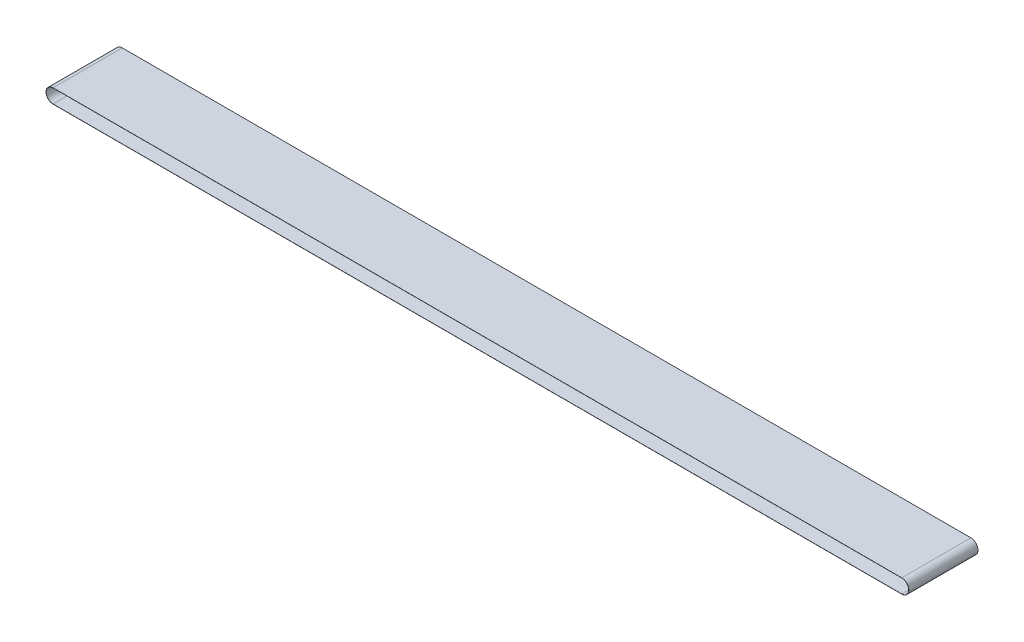
ISO-10303-21;
HEADER;
FILE_DESCRIPTION(('STEP AP214'),'2;1');
FILE_NAME('part.step','',(''),(''),'','','');
FILE_SCHEMA(('AUTOMOTIVE_DESIGN { 1 0 10303 214 1 1 1 1 }'));
ENDSEC;
DATA;
#1=APPLICATION_CONTEXT('core data for automotive mechanical design processes');
#2=APPLICATION_PROTOCOL_DEFINITION('international standard','automotive_design',2000,#1);
#3=PRODUCT_CONTEXT('',#1,'mechanical');
#4=PRODUCT('Part','Part','',(#3));
#5=PRODUCT_RELATED_PRODUCT_CATEGORY('part','',(#4));
#6=PRODUCT_DEFINITION_FORMATION('','',#4);
#7=PRODUCT_DEFINITION_CONTEXT('part definition',#1,'design');
#8=PRODUCT_DEFINITION('design','',#6,#7);
#9=PRODUCT_DEFINITION_SHAPE('','',#8);
#10=(LENGTH_UNIT() NAMED_UNIT(*) SI_UNIT(.MILLI.,.METRE.));
#11=(NAMED_UNIT(*) PLANE_ANGLE_UNIT() SI_UNIT($,.RADIAN.));
#12=(NAMED_UNIT(*) SI_UNIT($,.STERADIAN.) SOLID_ANGLE_UNIT());
#13=UNCERTAINTY_MEASURE_WITH_UNIT(LENGTH_MEASURE(1.E-05),#10,'distance_accuracy_value','');
#14=(GEOMETRIC_REPRESENTATION_CONTEXT(3) GLOBAL_UNCERTAINTY_ASSIGNED_CONTEXT((#13)) GLOBAL_UNIT_ASSIGNED_CONTEXT((#10,
#11,#12)) REPRESENTATION_CONTEXT('',''));
#15=CARTESIAN_POINT('',(0.,0.,0.));
#16=DIRECTION('',(0.,0.,1.));
#17=DIRECTION('',(1.,0.,0.));
#18=AXIS2_PLACEMENT_3D('',#15,#16,#17);
#19=CARTESIAN_POINT('',(0.,0.,250.));
#20=DIRECTION('',(0.,0.,1.));
#21=DIRECTION('',(1.,0.,0.));
#22=AXIS2_PLACEMENT_3D('',#19,#20,#21);
#23=PLANE('',#22);
#24=CARTESIAN_POINT('',(0.,0.,250.));
#25=DIRECTION('',(0.,0.,1.));
#26=DIRECTION('',(1.,0.,0.));
#27=AXIS2_PLACEMENT_3D('',#24,#25,#26);
#28=CIRCLE('',#27,51.2);
#29=CARTESIAN_POINT('',(0.,51.2,250.));
#30=VERTEX_POINT('',#29);
#31=CARTESIAN_POINT('',(0.,-51.2,250.));
#32=VERTEX_POINT('',#31);
#33=EDGE_CURVE('E134',#30,#32,#28,.T.);
#34=ORIENTED_EDGE('',*,*,#33,.T.);
#35=DIRECTION('',(1.,0.,0.));
#36=VECTOR('',#35,1.);
#37=CARTESIAN_POINT('',(0.,-51.2,250.));
#38=LINE('',#37,#36);
#39=CARTESIAN_POINT('',(6134.96,-51.2,250.));
#40=VERTEX_POINT('',#39);
#41=EDGE_CURVE('E137',#32,#40,#38,.T.);
#42=ORIENTED_EDGE('',*,*,#41,.T.);
#43=CARTESIAN_POINT('',(6134.96,0.,250.));
#44=DIRECTION('',(0.,0.,1.));
#45=DIRECTION('',(1.,0.,0.));
#46=AXIS2_PLACEMENT_3D('',#43,#44,#45);
#47=CIRCLE('',#46,51.2);
#48=CARTESIAN_POINT('',(6134.96,51.2,250.));
#49=VERTEX_POINT('',#48);
#50=EDGE_CURVE('E140',#40,#49,#47,.T.);
#51=ORIENTED_EDGE('',*,*,#50,.T.);
#52=DIRECTION('',(-1.,0.,0.));
#53=VECTOR('',#52,1.);
#54=CARTESIAN_POINT('',(0.,51.2,250.));
#55=LINE('',#54,#53);
#56=EDGE_CURVE('E142',#49,#30,#55,.T.);
#57=ORIENTED_EDGE('',*,*,#56,.T.);
#58=EDGE_LOOP('',(#34,#42,#51,#57));
#59=FACE_BOUND('',#58,.T.);
#60=DIRECTION('',(1.,0.,0.));
#61=VECTOR('',#60,1.);
#62=CARTESIAN_POINT('',(0.,-50.,250.));
#63=LINE('',#62,#61);
#64=CARTESIAN_POINT('',(0.,-50.,250.));
#65=VERTEX_POINT('',#64);
#66=CARTESIAN_POINT('',(6134.96,-50.,250.));
#67=VERTEX_POINT('',#66);
#68=EDGE_CURVE('E106',#65,#67,#63,.T.);
#69=ORIENTED_EDGE('',*,*,#68,.F.);
#70=CARTESIAN_POINT('',(0.,0.,250.));
#71=DIRECTION('',(0.,0.,1.));
#72=DIRECTION('',(1.,0.,0.));
#73=AXIS2_PLACEMENT_3D('',#70,#71,#72);
#74=CIRCLE('',#73,50.);
#75=CARTESIAN_POINT('',(0.,50.,250.));
#76=VERTEX_POINT('',#75);
#77=EDGE_CURVE('E98',#76,#65,#74,.T.);
#78=ORIENTED_EDGE('',*,*,#77,.F.);
#79=DIRECTION('',(-1.,0.,0.));
#80=VECTOR('',#79,1.);
#81=CARTESIAN_POINT('',(0.,50.,250.));
#82=LINE('',#81,#80);
#83=CARTESIAN_POINT('',(6134.96,50.,250.));
#84=VERTEX_POINT('',#83);
#85=EDGE_CURVE('E120',#84,#76,#82,.T.);
#86=ORIENTED_EDGE('',*,*,#85,.F.);
#87=CARTESIAN_POINT('',(6134.96,0.,250.));
#88=DIRECTION('',(0.,0.,1.));
#89=DIRECTION('',(1.,0.,0.));
#90=AXIS2_PLACEMENT_3D('',#87,#88,#89);
#91=CIRCLE('',#90,50.);
#92=EDGE_CURVE('E118',#67,#84,#91,.T.);
#93=ORIENTED_EDGE('',*,*,#92,.F.);
#94=EDGE_LOOP('',(#69,#78,#86,#93));
#95=FACE_BOUND('',#94,.T.);
#96=ADVANCED_FACE('F33',(#59,#95),#23,.T.);
#97=CARTESIAN_POINT('',(0.,0.,-250.));
#98=DIRECTION('',(0.,0.,1.));
#99=DIRECTION('',(1.,0.,0.));
#100=AXIS2_PLACEMENT_3D('',#97,#98,#99);
#101=PLANE('',#100);
#102=CARTESIAN_POINT('',(0.,0.,-250.));
#103=DIRECTION('',(0.,0.,1.));
#104=DIRECTION('',(1.,0.,0.));
#105=AXIS2_PLACEMENT_3D('',#102,#103,#104);
#106=CIRCLE('',#105,51.2);
#107=CARTESIAN_POINT('',(0.,51.2,-250.));
#108=VERTEX_POINT('',#107);
#109=CARTESIAN_POINT('',(0.,-51.2,-250.));
#110=VERTEX_POINT('',#109);
#111=EDGE_CURVE('E114',#108,#110,#106,.T.);
#112=ORIENTED_EDGE('',*,*,#111,.F.);
#113=DIRECTION('',(-1.,0.,0.));
#114=VECTOR('',#113,1.);
#115=CARTESIAN_POINT('',(0.,51.2,-250.));
#116=LINE('',#115,#114);
#117=CARTESIAN_POINT('',(6134.96,51.2,-250.));
#118=VERTEX_POINT('',#117);
#119=EDGE_CURVE('E138',#118,#108,#116,.T.);
#120=ORIENTED_EDGE('',*,*,#119,.F.);
#121=CARTESIAN_POINT('',(6134.96,0.,-250.));
#122=DIRECTION('',(0.,0.,1.));
#123=DIRECTION('',(1.,0.,0.));
#124=AXIS2_PLACEMENT_3D('',#121,#122,#123);
#125=CIRCLE('',#124,51.2);
#126=CARTESIAN_POINT('',(6134.96,-51.2,-250.));
#127=VERTEX_POINT('',#126);
#128=EDGE_CURVE('E149',#127,#118,#125,.T.);
#129=ORIENTED_EDGE('',*,*,#128,.F.);
#130=DIRECTION('',(1.,0.,0.));
#131=VECTOR('',#130,1.);
#132=CARTESIAN_POINT('',(0.,-51.2,-250.));
#133=LINE('',#132,#131);
#134=EDGE_CURVE('E147',#110,#127,#133,.T.);
#135=ORIENTED_EDGE('',*,*,#134,.F.);
#136=EDGE_LOOP('',(#112,#120,#129,#135));
#137=FACE_BOUND('',#136,.T.);
#138=CARTESIAN_POINT('',(0.,0.,-250.));
#139=DIRECTION('',(0.,0.,1.));
#140=DIRECTION('',(1.,0.,0.));
#141=AXIS2_PLACEMENT_3D('',#138,#139,#140);
#142=CIRCLE('',#141,50.);
#143=CARTESIAN_POINT('',(0.,50.,-250.));
#144=VERTEX_POINT('',#143);
#145=CARTESIAN_POINT('',(0.,-50.,-250.));
#146=VERTEX_POINT('',#145);
#147=EDGE_CURVE('E56',#144,#146,#142,.T.);
#148=ORIENTED_EDGE('',*,*,#147,.T.);
#149=DIRECTION('',(1.,0.,0.));
#150=VECTOR('',#149,1.);
#151=CARTESIAN_POINT('',(0.,-50.,-250.));
#152=LINE('',#151,#150);
#153=CARTESIAN_POINT('',(6134.96,-50.,-250.));
#154=VERTEX_POINT('',#153);
#155=EDGE_CURVE('E113',#146,#154,#152,.T.);
#156=ORIENTED_EDGE('',*,*,#155,.T.);
#157=CARTESIAN_POINT('',(6134.96,0.,-250.));
#158=DIRECTION('',(0.,0.,1.));
#159=DIRECTION('',(1.,0.,0.));
#160=AXIS2_PLACEMENT_3D('',#157,#158,#159);
#161=CIRCLE('',#160,50.);
#162=CARTESIAN_POINT('',(6134.96,50.,-250.));
#163=VERTEX_POINT('',#162);
#164=EDGE_CURVE('E126',#154,#163,#161,.T.);
#165=ORIENTED_EDGE('',*,*,#164,.T.);
#166=DIRECTION('',(-1.,0.,0.));
#167=VECTOR('',#166,1.);
#168=CARTESIAN_POINT('',(0.,50.,-250.));
#169=LINE('',#168,#167);
#170=EDGE_CURVE('E107',#163,#144,#169,.T.);
#171=ORIENTED_EDGE('',*,*,#170,.T.);
#172=EDGE_LOOP('',(#148,#156,#165,#171));
#173=FACE_BOUND('',#172,.T.);
#174=ADVANCED_FACE('F167',(#137,#173),#101,.F.);
#175=CARTESIAN_POINT('',(0.,0.,250.));
#176=DIRECTION('',(0.,0.,-1.));
#177=DIRECTION('',(-1.,0.,0.));
#178=AXIS2_PLACEMENT_3D('',#175,#176,#177);
#179=CYLINDRICAL_SURFACE('',#178,51.2);
#180=ORIENTED_EDGE('',*,*,#111,.T.);
#181=DIRECTION('',(0.,0.,-1.));
#182=VECTOR('',#181,1.);
#183=CARTESIAN_POINT('',(0.,-51.2,250.));
#184=LINE('',#183,#182);
#185=EDGE_CURVE('E11',#32,#110,#184,.T.);
#186=ORIENTED_EDGE('',*,*,#185,.F.);
#187=ORIENTED_EDGE('',*,*,#33,.F.);
#188=DIRECTION('',(0.,0.,-1.));
#189=VECTOR('',#188,1.);
#190=CARTESIAN_POINT('',(0.,51.2,250.));
#191=LINE('',#190,#189);
#192=EDGE_CURVE('E144',#30,#108,#191,.T.);
#193=ORIENTED_EDGE('',*,*,#192,.T.);
#194=EDGE_LOOP('',(#180,#186,#187,#193));
#195=FACE_BOUND('',#194,.T.);
#196=ADVANCED_FACE('F35',(#195),#179,.T.);
#197=CARTESIAN_POINT('',(0.,-51.2,250.));
#198=DIRECTION('',(0.,1.,0.));
#199=DIRECTION('',(0.,0.,1.));
#200=AXIS2_PLACEMENT_3D('',#197,#198,#199);
#201=PLANE('',#200);
#202=ORIENTED_EDGE('',*,*,#134,.T.);
#203=DIRECTION('',(0.,0.,-1.));
#204=VECTOR('',#203,1.);
#205=CARTESIAN_POINT('',(6134.96,-51.2,250.));
#206=LINE('',#205,#204);
#207=EDGE_CURVE('E41',#40,#127,#206,.T.);
#208=ORIENTED_EDGE('',*,*,#207,.F.);
#209=ORIENTED_EDGE('',*,*,#41,.F.);
#210=ORIENTED_EDGE('',*,*,#185,.T.);
#211=EDGE_LOOP('',(#202,#208,#209,#210));
#212=FACE_BOUND('',#211,.T.);
#213=ADVANCED_FACE('F177',(#212),#201,.F.);
#214=CARTESIAN_POINT('',(6134.96,0.,250.));
#215=DIRECTION('',(0.,0.,-1.));
#216=DIRECTION('',(-1.,0.,0.));
#217=AXIS2_PLACEMENT_3D('',#214,#215,#216);
#218=CYLINDRICAL_SURFACE('',#217,51.2);
#219=ORIENTED_EDGE('',*,*,#128,.T.);
#220=DIRECTION('',(0.,0.,-1.));
#221=VECTOR('',#220,1.);
#222=CARTESIAN_POINT('',(6134.96,51.2,250.));
#223=LINE('',#222,#221);
#224=EDGE_CURVE('E154',#49,#118,#223,.T.);
#225=ORIENTED_EDGE('',*,*,#224,.F.);
#226=ORIENTED_EDGE('',*,*,#50,.F.);
#227=ORIENTED_EDGE('',*,*,#207,.T.);
#228=EDGE_LOOP('',(#219,#225,#226,#227));
#229=FACE_BOUND('',#228,.T.);
#230=ADVANCED_FACE('F161',(#229),#218,.T.);
#231=CARTESIAN_POINT('',(0.,51.2,250.));
#232=DIRECTION('',(0.,-1.,0.));
#233=DIRECTION('',(0.,0.,-1.));
#234=AXIS2_PLACEMENT_3D('',#231,#232,#233);
#235=PLANE('',#234);
#236=ORIENTED_EDGE('',*,*,#119,.T.);
#237=ORIENTED_EDGE('',*,*,#192,.F.);
#238=ORIENTED_EDGE('',*,*,#56,.F.);
#239=ORIENTED_EDGE('',*,*,#224,.T.);
#240=EDGE_LOOP('',(#236,#237,#238,#239));
#241=FACE_BOUND('',#240,.T.);
#242=ADVANCED_FACE('F171',(#241),#235,.F.);
#243=CARTESIAN_POINT('',(0.,0.,250.));
#244=DIRECTION('',(0.,0.,-1.));
#245=DIRECTION('',(-1.,0.,0.));
#246=AXIS2_PLACEMENT_3D('',#243,#244,#245);
#247=CYLINDRICAL_SURFACE('',#246,50.);
#248=ORIENTED_EDGE('',*,*,#147,.F.);
#249=DIRECTION('',(0.,0.,-1.));
#250=VECTOR('',#249,1.);
#251=CARTESIAN_POINT('',(0.,50.,250.));
#252=LINE('',#251,#250);
#253=EDGE_CURVE('E102',#76,#144,#252,.T.);
#254=ORIENTED_EDGE('',*,*,#253,.F.);
#255=ORIENTED_EDGE('',*,*,#77,.T.);
#256=DIRECTION('',(0.,0.,-1.));
#257=VECTOR('',#256,1.);
#258=CARTESIAN_POINT('',(0.,-50.,250.));
#259=LINE('',#258,#257);
#260=EDGE_CURVE('E101',#65,#146,#259,.T.);
#261=ORIENTED_EDGE('',*,*,#260,.T.);
#262=EDGE_LOOP('',(#248,#254,#255,#261));
#263=FACE_BOUND('',#262,.T.);
#264=ADVANCED_FACE('F100',(#263),#247,.F.);
#265=CARTESIAN_POINT('',(0.,-50.,250.));
#266=DIRECTION('',(0.,1.,0.));
#267=DIRECTION('',(0.,0.,1.));
#268=AXIS2_PLACEMENT_3D('',#265,#266,#267);
#269=PLANE('',#268);
#270=ORIENTED_EDGE('',*,*,#155,.F.);
#271=ORIENTED_EDGE('',*,*,#260,.F.);
#272=ORIENTED_EDGE('',*,*,#68,.T.);
#273=DIRECTION('',(0.,0.,-1.));
#274=VECTOR('',#273,1.);
#275=CARTESIAN_POINT('',(6134.96,-50.,250.));
#276=LINE('',#275,#274);
#277=EDGE_CURVE('E115',#67,#154,#276,.T.);
#278=ORIENTED_EDGE('',*,*,#277,.T.);
#279=EDGE_LOOP('',(#270,#271,#272,#278));
#280=FACE_BOUND('',#279,.T.);
#281=ADVANCED_FACE('F110',(#280),#269,.T.);
#282=CARTESIAN_POINT('',(6134.96,0.,250.));
#283=DIRECTION('',(0.,0.,-1.));
#284=DIRECTION('',(-1.,0.,0.));
#285=AXIS2_PLACEMENT_3D('',#282,#283,#284);
#286=CYLINDRICAL_SURFACE('',#285,50.);
#287=ORIENTED_EDGE('',*,*,#164,.F.);
#288=ORIENTED_EDGE('',*,*,#277,.F.);
#289=ORIENTED_EDGE('',*,*,#92,.T.);
#290=DIRECTION('',(0.,0.,-1.));
#291=VECTOR('',#290,1.);
#292=CARTESIAN_POINT('',(6134.96,50.,250.));
#293=LINE('',#292,#291);
#294=EDGE_CURVE('E48',#84,#163,#293,.T.);
#295=ORIENTED_EDGE('',*,*,#294,.T.);
#296=EDGE_LOOP('',(#287,#288,#289,#295));
#297=FACE_BOUND('',#296,.T.);
#298=ADVANCED_FACE('F200',(#297),#286,.F.);
#299=CARTESIAN_POINT('',(0.,50.,250.));
#300=DIRECTION('',(0.,-1.,0.));
#301=DIRECTION('',(0.,0.,-1.));
#302=AXIS2_PLACEMENT_3D('',#299,#300,#301);
#303=PLANE('',#302);
#304=ORIENTED_EDGE('',*,*,#170,.F.);
#305=ORIENTED_EDGE('',*,*,#294,.F.);
#306=ORIENTED_EDGE('',*,*,#85,.T.);
#307=ORIENTED_EDGE('',*,*,#253,.T.);
#308=EDGE_LOOP('',(#304,#305,#306,#307));
#309=FACE_BOUND('',#308,.T.);
#310=ADVANCED_FACE('F204',(#309),#303,.T.);
#311=CLOSED_SHELL('',(#96,#174,#196,#213,#230,#242,#264,#281,#298,#310));
#312=MANIFOLD_SOLID_BREP('B2',#311);
#313=ADVANCED_BREP_SHAPE_REPRESENTATION('',(#18,#312),#14);
#314=SHAPE_DEFINITION_REPRESENTATION(#9,#313);
ENDSEC;
END-ISO-10303-21;
